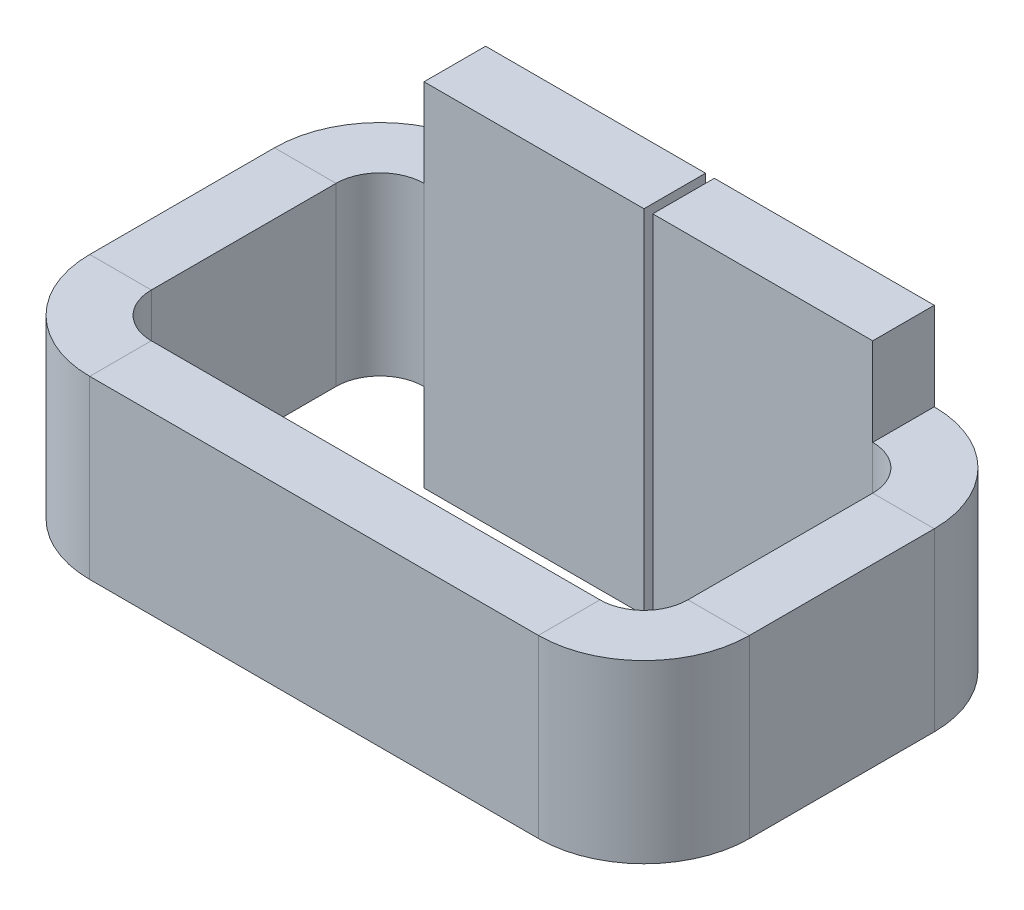
ISO-10303-21;
HEADER;
FILE_DESCRIPTION(('STEP AP214'),'2;1');
FILE_NAME('part.step','',(''),(''),'','','');
FILE_SCHEMA(('AUTOMOTIVE_DESIGN { 1 0 10303 214 1 1 1 1 }'));
ENDSEC;
DATA;
#1=APPLICATION_CONTEXT('core data for automotive mechanical design processes');
#2=APPLICATION_PROTOCOL_DEFINITION('international standard','automotive_design',2000,#1);
#3=PRODUCT_CONTEXT('',#1,'mechanical');
#4=PRODUCT('Part','Part','',(#3));
#5=PRODUCT_RELATED_PRODUCT_CATEGORY('part','',(#4));
#6=PRODUCT_DEFINITION_FORMATION('','',#4);
#7=PRODUCT_DEFINITION_CONTEXT('part definition',#1,'design');
#8=PRODUCT_DEFINITION('design','',#6,#7);
#9=PRODUCT_DEFINITION_SHAPE('','',#8);
#10=(LENGTH_UNIT() NAMED_UNIT(*) SI_UNIT(.MILLI.,.METRE.));
#11=(NAMED_UNIT(*) PLANE_ANGLE_UNIT() SI_UNIT($,.RADIAN.));
#12=(NAMED_UNIT(*) SI_UNIT($,.STERADIAN.) SOLID_ANGLE_UNIT());
#13=UNCERTAINTY_MEASURE_WITH_UNIT(LENGTH_MEASURE(1.E-05),#10,'distance_accuracy_value','');
#14=(GEOMETRIC_REPRESENTATION_CONTEXT(3) GLOBAL_UNCERTAINTY_ASSIGNED_CONTEXT((#13)) GLOBAL_UNIT_ASSIGNED_CONTEXT((#10,
#11,#12)) REPRESENTATION_CONTEXT('',''));
#15=CARTESIAN_POINT('',(0.,0.,0.));
#16=DIRECTION('',(0.,0.,1.));
#17=DIRECTION('',(1.,0.,0.));
#18=AXIS2_PLACEMENT_3D('',#15,#16,#17);
#19=CARTESIAN_POINT('',(3.7186584278201,-0.507055120000001,2.286));
#20=DIRECTION('',(0.,1.,0.));
#21=DIRECTION('',(1.,0.,0.));
#22=AXIS2_PLACEMENT_3D('',#19,#20,#21);
#23=PLANE('',#22);
#24=DIRECTION('',(0.,0.,1.));
#25=VECTOR('',#24,1.);
#26=CARTESIAN_POINT('',(-1.29548128,-0.507055119999999,1.9304));
#27=LINE('',#26,#25);
#28=CARTESIAN_POINT('',(-1.29548128,-0.507055119999999,1.9304));
#29=VERTEX_POINT('',#28);
#30=CARTESIAN_POINT('',(-1.29548128,-0.507055119999999,2.286));
#31=VERTEX_POINT('',#30);
#32=EDGE_CURVE('E11',#29,#31,#27,.T.);
#33=ORIENTED_EDGE('',*,*,#32,.F.);
#34=DIRECTION('',(1.,0.,0.));
#35=VECTOR('',#34,1.);
#36=CARTESIAN_POINT('',(3.7186584278201,-0.507055120000001,1.9304));
#37=LINE('',#36,#35);
#38=CARTESIAN_POINT('',(1.29531872,-0.50705512,1.9304));
#39=VERTEX_POINT('',#38);
#40=EDGE_CURVE('E23',#29,#39,#37,.T.);
#41=ORIENTED_EDGE('',*,*,#40,.T.);
#42=DIRECTION('',(0.,0.,-1.));
#43=VECTOR('',#42,1.);
#44=CARTESIAN_POINT('',(1.29531872,-0.50705512,2.286));
#45=LINE('',#44,#43);
#46=CARTESIAN_POINT('',(1.29531872,-0.50705512,2.286));
#47=VERTEX_POINT('',#46);
#48=EDGE_CURVE('E511',#47,#39,#45,.T.);
#49=ORIENTED_EDGE('',*,*,#48,.F.);
#50=DIRECTION('',(1.,0.,0.));
#51=VECTOR('',#50,1.);
#52=CARTESIAN_POINT('',(3.7186584278201,-0.507055120000001,2.286));
#53=LINE('',#52,#51);
#54=EDGE_CURVE('E508',#31,#47,#53,.T.);
#55=ORIENTED_EDGE('',*,*,#54,.F.);
#56=EDGE_LOOP('',(#33,#41,#49,#55));
#57=FACE_BOUND('',#56,.T.);
#58=ADVANCED_FACE('F16',(#57),#23,.F.);
#59=CARTESIAN_POINT('',(3.7186584278201,0.508944879999999,2.286));
#60=DIRECTION('',(0.,-1.,0.));
#61=DIRECTION('',(-1.,0.,0.));
#62=AXIS2_PLACEMENT_3D('',#59,#60,#61);
#63=PLANE('',#62);
#64=DIRECTION('',(0.,0.,-1.));
#65=VECTOR('',#64,1.);
#66=CARTESIAN_POINT('',(-1.29548128,0.508944880000001,2.286));
#67=LINE('',#66,#65);
#68=CARTESIAN_POINT('',(-1.29548128,0.508944880000001,2.286));
#69=VERTEX_POINT('',#68);
#70=CARTESIAN_POINT('',(-1.29548128,0.508944880000001,1.9304));
#71=VERTEX_POINT('',#70);
#72=EDGE_CURVE('E506',#69,#71,#67,.T.);
#73=ORIENTED_EDGE('',*,*,#72,.F.);
#74=DIRECTION('',(-1.,0.,0.));
#75=VECTOR('',#74,1.);
#76=CARTESIAN_POINT('',(3.7186584278201,0.508944879999999,2.286));
#77=LINE('',#76,#75);
#78=CARTESIAN_POINT('',(1.29531872,0.50894488,2.286));
#79=VERTEX_POINT('',#78);
#80=EDGE_CURVE('E503',#79,#69,#77,.T.);
#81=ORIENTED_EDGE('',*,*,#80,.F.);
#82=DIRECTION('',(0.,0.,1.));
#83=VECTOR('',#82,1.);
#84=CARTESIAN_POINT('',(1.29531872,0.50894488,1.9304));
#85=LINE('',#84,#83);
#86=CARTESIAN_POINT('',(1.29531872,0.50894488,1.9304));
#87=VERTEX_POINT('',#86);
#88=EDGE_CURVE('E500',#87,#79,#85,.T.);
#89=ORIENTED_EDGE('',*,*,#88,.F.);
#90=DIRECTION('',(-1.,0.,0.));
#91=VECTOR('',#90,1.);
#92=CARTESIAN_POINT('',(3.7186584278201,0.508944879999999,1.9304));
#93=LINE('',#92,#91);
#94=EDGE_CURVE('E497',#87,#71,#93,.T.);
#95=ORIENTED_EDGE('',*,*,#94,.T.);
#96=EDGE_LOOP('',(#73,#81,#89,#95));
#97=FACE_BOUND('',#96,.T.);
#98=ADVANCED_FACE('F611',(#97),#63,.F.);
#99=CARTESIAN_POINT('',(1.29531872,-1.01505512,2.286));
#100=DIRECTION('',(0.,0.,1.));
#101=DIRECTION('',(-1.,0.,0.));
#102=AXIS2_PLACEMENT_3D('',#99,#100,#101);
#103=PLANE('',#102);
#104=ORIENTED_EDGE('',*,*,#80,.T.);
#105=DIRECTION('',(0.,1.,0.));
#106=VECTOR('',#105,1.);
#107=CARTESIAN_POINT('',(-1.29548128,-1.01505512,2.286));
#108=LINE('',#107,#106);
#109=EDGE_CURVE('E494',#31,#69,#108,.T.);
#110=ORIENTED_EDGE('',*,*,#109,.F.);
#111=ORIENTED_EDGE('',*,*,#54,.T.);
#112=DIRECTION('',(0.,1.,0.));
#113=VECTOR('',#112,1.);
#114=CARTESIAN_POINT('',(1.29531872,-1.01505512,2.286));
#115=LINE('',#114,#113);
#116=EDGE_CURVE('E491',#47,#79,#115,.T.);
#117=ORIENTED_EDGE('',*,*,#116,.T.);
#118=EDGE_LOOP('',(#104,#110,#111,#117));
#119=FACE_BOUND('',#118,.T.);
#120=ADVANCED_FACE('F542',(#119),#103,.T.);
#121=CARTESIAN_POINT('',(1.29531872,-1.01505512,1.9304));
#122=DIRECTION('',(0.,0.,1.));
#123=DIRECTION('',(-1.,0.,0.));
#124=AXIS2_PLACEMENT_3D('',#121,#122,#123);
#125=PLANE('',#124);
#126=DIRECTION('',(0.,1.,0.));
#127=VECTOR('',#126,1.);
#128=CARTESIAN_POINT('',(-1.29548128,-1.01505512,1.9304));
#129=LINE('',#128,#127);
#130=EDGE_CURVE('E488',#29,#71,#129,.T.);
#131=ORIENTED_EDGE('',*,*,#130,.T.);
#132=ORIENTED_EDGE('',*,*,#94,.F.);
#133=DIRECTION('',(0.,1.,0.));
#134=VECTOR('',#133,1.);
#135=CARTESIAN_POINT('',(1.29531872,-1.01505512,1.9304));
#136=LINE('',#135,#134);
#137=EDGE_CURVE('E485',#39,#87,#136,.T.);
#138=ORIENTED_EDGE('',*,*,#137,.F.);
#139=ORIENTED_EDGE('',*,*,#40,.F.);
#140=EDGE_LOOP('',(#131,#132,#138,#139));
#141=FACE_BOUND('',#140,.T.);
#142=ADVANCED_FACE('F525',(#141),#125,.F.);
#143=CARTESIAN_POINT('',(0.02531872,-1.01505512,0.));
#144=DIRECTION('',(-1.,0.,0.));
#145=DIRECTION('',(0.,0.,-1.));
#146=AXIS2_PLACEMENT_3D('',#143,#144,#145);
#147=PLANE('',#146);
#148=DIRECTION('',(0.,0.,1.));
#149=VECTOR('',#148,1.);
#150=CARTESIAN_POINT('',(0.0253187200000005,1.01694488,0.));
#151=LINE('',#150,#149);
#152=CARTESIAN_POINT('',(0.0253187200000005,1.01694488,0.));
#153=VERTEX_POINT('',#152);
#154=CARTESIAN_POINT('',(0.0253187200000005,1.01694488,0.3556));
#155=VERTEX_POINT('',#154);
#156=EDGE_CURVE('E482',#153,#155,#151,.T.);
#157=ORIENTED_EDGE('',*,*,#156,.F.);
#158=DIRECTION('',(0.,1.,0.));
#159=VECTOR('',#158,1.);
#160=CARTESIAN_POINT('',(0.02531872,-1.01505512,0.));
#161=LINE('',#160,#159);
#162=CARTESIAN_POINT('',(0.02531872,-1.01505512,0.));
#163=VERTEX_POINT('',#162);
#164=EDGE_CURVE('E478',#163,#153,#161,.T.);
#165=ORIENTED_EDGE('',*,*,#164,.F.);
#166=DIRECTION('',(0.,0.,1.));
#167=VECTOR('',#166,1.);
#168=CARTESIAN_POINT('',(0.02531872,-1.01505512,0.));
#169=LINE('',#168,#167);
#170=CARTESIAN_POINT('',(0.02531872,-1.01505512,0.3556));
#171=VERTEX_POINT('',#170);
#172=EDGE_CURVE('E475',#163,#171,#169,.T.);
#173=ORIENTED_EDGE('',*,*,#172,.T.);
#174=DIRECTION('',(0.,1.,0.));
#175=VECTOR('',#174,1.);
#176=CARTESIAN_POINT('',(0.02531872,-1.01505512,0.3556));
#177=LINE('',#176,#175);
#178=EDGE_CURVE('E471',#171,#155,#177,.T.);
#179=ORIENTED_EDGE('',*,*,#178,.T.);
#180=EDGE_LOOP('',(#157,#165,#173,#179));
#181=FACE_BOUND('',#180,.T.);
#182=ADVANCED_FACE('F623',(#181),#147,.T.);
#183=CARTESIAN_POINT('',(1.54931872,-1.01505512,0.6096));
#184=DIRECTION('',(0.,-1.,0.));
#185=DIRECTION('',(1.,0.,0.));
#186=AXIS2_PLACEMENT_3D('',#183,#184,#185);
#187=PLANE('',#186);
#188=DIRECTION('',(-1.,0.,0.));
#189=VECTOR('',#188,1.);
#190=CARTESIAN_POINT('',(0.02531872,-1.01505512,0.));
#191=LINE('',#190,#189);
#192=CARTESIAN_POINT('',(1.29531872,-1.01505512,0.));
#193=VERTEX_POINT('',#192);
#194=EDGE_CURVE('E467',#193,#163,#191,.T.);
#195=ORIENTED_EDGE('',*,*,#194,.F.);
#196=DIRECTION('',(0.,0.,1.));
#197=VECTOR('',#196,1.);
#198=CARTESIAN_POINT('',(1.29531872,-1.01505512,0.));
#199=LINE('',#198,#197);
#200=CARTESIAN_POINT('',(1.29531872,-1.01505512,0.3556));
#201=VERTEX_POINT('',#200);
#202=EDGE_CURVE('E463',#193,#201,#199,.T.);
#203=ORIENTED_EDGE('',*,*,#202,.T.);
#204=DIRECTION('',(-1.,0.,0.));
#205=VECTOR('',#204,1.);
#206=CARTESIAN_POINT('',(0.02531872,-1.01505512,0.3556));
#207=LINE('',#206,#205);
#208=EDGE_CURVE('E459',#201,#171,#207,.T.);
#209=ORIENTED_EDGE('',*,*,#208,.T.);
#210=ORIENTED_EDGE('',*,*,#172,.F.);
#211=EDGE_LOOP('',(#195,#203,#209,#210));
#212=FACE_BOUND('',#211,.T.);
#213=ADVANCED_FACE('F626',(#212),#187,.T.);
#214=CARTESIAN_POINT('',(1.29531872,1.01694488,0.6096));
#215=DIRECTION('',(0.,1.,0.));
#216=DIRECTION('',(-1.,0.,0.));
#217=AXIS2_PLACEMENT_3D('',#214,#215,#216);
#218=PLANE('',#217);
#219=DIRECTION('',(-1.,0.,0.));
#220=VECTOR('',#219,1.);
#221=CARTESIAN_POINT('',(0.0253187200000005,1.01694488,0.3556));
#222=LINE('',#221,#220);
#223=CARTESIAN_POINT('',(1.29531872,1.01694488,0.3556));
#224=VERTEX_POINT('',#223);
#225=EDGE_CURVE('E455',#224,#155,#222,.T.);
#226=ORIENTED_EDGE('',*,*,#225,.F.);
#227=DIRECTION('',(0.,0.,-1.));
#228=VECTOR('',#227,1.);
#229=CARTESIAN_POINT('',(1.29531872,1.01694488,0.3556));
#230=LINE('',#229,#228);
#231=CARTESIAN_POINT('',(1.29531872,1.01694488,0.));
#232=VERTEX_POINT('',#231);
#233=EDGE_CURVE('E451',#224,#232,#230,.T.);
#234=ORIENTED_EDGE('',*,*,#233,.T.);
#235=DIRECTION('',(-1.,0.,0.));
#236=VECTOR('',#235,1.);
#237=CARTESIAN_POINT('',(0.0253187200000005,1.01694488,0.));
#238=LINE('',#237,#236);
#239=EDGE_CURVE('E447',#232,#153,#238,.T.);
#240=ORIENTED_EDGE('',*,*,#239,.T.);
#241=ORIENTED_EDGE('',*,*,#156,.T.);
#242=EDGE_LOOP('',(#226,#234,#240,#241));
#243=FACE_BOUND('',#242,.T.);
#244=ADVANCED_FACE('F630',(#243),#218,.T.);
#245=CARTESIAN_POINT('',(1.29531872,1.01694488,0.));
#246=DIRECTION('',(-1.,0.,0.));
#247=DIRECTION('',(0.,-1.,0.));
#248=AXIS2_PLACEMENT_3D('',#245,#246,#247);
#249=PLANE('',#248);
#250=DIRECTION('',(0.,-1.,0.));
#251=VECTOR('',#250,1.);
#252=CARTESIAN_POINT('',(1.29531872,1.01694488,0.3556));
#253=LINE('',#252,#251);
#254=CARTESIAN_POINT('',(1.29531872,0.50894488,0.3556));
#255=VERTEX_POINT('',#254);
#256=EDGE_CURVE('E444',#224,#255,#253,.T.);
#257=ORIENTED_EDGE('',*,*,#256,.T.);
#258=DIRECTION('',(0.,0.,1.));
#259=VECTOR('',#258,1.);
#260=CARTESIAN_POINT('',(1.29531872,0.50894488,0.));
#261=LINE('',#260,#259);
#262=CARTESIAN_POINT('',(1.29531872,0.50894488,0.));
#263=VERTEX_POINT('',#262);
#264=EDGE_CURVE('E440',#263,#255,#261,.T.);
#265=ORIENTED_EDGE('',*,*,#264,.F.);
#266=DIRECTION('',(0.,-1.,0.));
#267=VECTOR('',#266,1.);
#268=CARTESIAN_POINT('',(1.29531872,1.01694488,0.));
#269=LINE('',#268,#267);
#270=EDGE_CURVE('E436',#232,#263,#269,.T.);
#271=ORIENTED_EDGE('',*,*,#270,.F.);
#272=ORIENTED_EDGE('',*,*,#233,.F.);
#273=EDGE_LOOP('',(#257,#265,#271,#272));
#274=FACE_BOUND('',#273,.T.);
#275=ADVANCED_FACE('F634',(#274),#249,.F.);
#276=CARTESIAN_POINT('',(0.02531872,-1.01505512,0.3556));
#277=DIRECTION('',(0.,0.,-1.));
#278=DIRECTION('',(1.,0.,0.));
#279=AXIS2_PLACEMENT_3D('',#276,#277,#278);
#280=PLANE('',#279);
#281=ORIENTED_EDGE('',*,*,#225,.T.);
#282=ORIENTED_EDGE('',*,*,#178,.F.);
#283=ORIENTED_EDGE('',*,*,#208,.F.);
#284=DIRECTION('',(0.,1.,0.));
#285=VECTOR('',#284,1.);
#286=CARTESIAN_POINT('',(1.29531872,-1.01505512,0.3556));
#287=LINE('',#286,#285);
#288=CARTESIAN_POINT('',(1.29531872,-0.50705512,0.3556));
#289=VERTEX_POINT('',#288);
#290=EDGE_CURVE('E432',#201,#289,#287,.T.);
#291=ORIENTED_EDGE('',*,*,#290,.T.);
#292=DIRECTION('',(0.,1.,0.));
#293=VECTOR('',#292,1.);
#294=CARTESIAN_POINT('',(1.29531872,-1.01505512,0.3556));
#295=LINE('',#294,#293);
#296=EDGE_CURVE('E428',#289,#255,#295,.T.);
#297=ORIENTED_EDGE('',*,*,#296,.T.);
#298=ORIENTED_EDGE('',*,*,#256,.F.);
#299=EDGE_LOOP('',(#281,#282,#283,#291,#297,#298));
#300=FACE_BOUND('',#299,.T.);
#301=ADVANCED_FACE('F638',(#300),#280,.F.);
#302=CARTESIAN_POINT('',(1.29531872,-1.01505512,0.));
#303=DIRECTION('',(-1.,0.,0.));
#304=DIRECTION('',(0.,-1.,0.));
#305=AXIS2_PLACEMENT_3D('',#302,#303,#304);
#306=PLANE('',#305);
#307=ORIENTED_EDGE('',*,*,#290,.F.);
#308=ORIENTED_EDGE('',*,*,#202,.F.);
#309=DIRECTION('',(0.,1.,0.));
#310=VECTOR('',#309,1.);
#311=CARTESIAN_POINT('',(1.29531872,-1.01505512,0.));
#312=LINE('',#311,#310);
#313=CARTESIAN_POINT('',(1.29531872,-0.50705512,0.));
#314=VERTEX_POINT('',#313);
#315=EDGE_CURVE('E424',#193,#314,#312,.T.);
#316=ORIENTED_EDGE('',*,*,#315,.T.);
#317=DIRECTION('',(0.,0.,1.));
#318=VECTOR('',#317,1.);
#319=CARTESIAN_POINT('',(1.29531872,-0.50705512,0.));
#320=LINE('',#319,#318);
#321=EDGE_CURVE('E420',#314,#289,#320,.T.);
#322=ORIENTED_EDGE('',*,*,#321,.T.);
#323=EDGE_LOOP('',(#307,#308,#316,#322));
#324=FACE_BOUND('',#323,.T.);
#325=ADVANCED_FACE('F642',(#324),#306,.F.);
#326=CARTESIAN_POINT('',(0.02531872,-1.01505512,0.));
#327=DIRECTION('',(0.,0.,-1.));
#328=DIRECTION('',(1.,0.,0.));
#329=AXIS2_PLACEMENT_3D('',#326,#327,#328);
#330=PLANE('',#329);
#331=ORIENTED_EDGE('',*,*,#239,.F.);
#332=ORIENTED_EDGE('',*,*,#270,.T.);
#333=DIRECTION('',(0.,1.,0.));
#334=VECTOR('',#333,1.);
#335=CARTESIAN_POINT('',(1.29531872,-1.01505512,0.));
#336=LINE('',#335,#334);
#337=EDGE_CURVE('E416',#314,#263,#336,.T.);
#338=ORIENTED_EDGE('',*,*,#337,.F.);
#339=ORIENTED_EDGE('',*,*,#315,.F.);
#340=ORIENTED_EDGE('',*,*,#194,.T.);
#341=ORIENTED_EDGE('',*,*,#164,.T.);
#342=EDGE_LOOP('',(#331,#332,#338,#339,#340,#341));
#343=FACE_BOUND('',#342,.T.);
#344=ADVANCED_FACE('F646',(#343),#330,.T.);
#345=CARTESIAN_POINT('',(1.29531872,0.50894488,0.6096));
#346=DIRECTION('',(0.,1.,0.));
#347=DIRECTION('',(-1.,0.,0.));
#348=AXIS2_PLACEMENT_3D('',#345,#346,#347);
#349=PLANE('',#348);
#350=ORIENTED_EDGE('',*,*,#264,.T.);
#351=CARTESIAN_POINT('',(1.29531872,0.50894488,0.6096));
#352=DIRECTION('',(0.,-1.,0.));
#353=DIRECTION('',(1.,0.,0.));
#354=AXIS2_PLACEMENT_3D('',#351,#352,#353);
#355=CIRCLE('',#354,0.254);
#356=CARTESIAN_POINT('',(1.54931872,0.50894488,0.609599999999999));
#357=VERTEX_POINT('',#356);
#358=EDGE_CURVE('E413',#255,#357,#355,.T.);
#359=ORIENTED_EDGE('',*,*,#358,.T.);
#360=DIRECTION('',(1.,0.,0.));
#361=VECTOR('',#360,1.);
#362=CARTESIAN_POINT('',(1.54931872,0.50894488,0.6096));
#363=LINE('',#362,#361);
#364=CARTESIAN_POINT('',(1.90491872,0.50894488,0.6096));
#365=VERTEX_POINT('',#364);
#366=EDGE_CURVE('E409',#357,#365,#363,.T.);
#367=ORIENTED_EDGE('',*,*,#366,.T.);
#368=CARTESIAN_POINT('',(1.29531872,0.50894488,0.6096));
#369=DIRECTION('',(0.,-1.,0.));
#370=DIRECTION('',(1.,0.,0.));
#371=AXIS2_PLACEMENT_3D('',#368,#369,#370);
#372=CIRCLE('',#371,0.6096);
#373=EDGE_CURVE('E405',#263,#365,#372,.T.);
#374=ORIENTED_EDGE('',*,*,#373,.F.);
#375=EDGE_LOOP('',(#350,#359,#367,#374));
#376=FACE_BOUND('',#375,.T.);
#377=ADVANCED_FACE('F650',(#376),#349,.T.);
#378=CARTESIAN_POINT('',(1.29531872,1.2732488353201,0.6096));
#379=DIRECTION('',(0.,-1.,0.));
#380=DIRECTION('',(1.,0.,0.));
#381=AXIS2_PLACEMENT_3D('',#378,#379,#380);
#382=CYLINDRICAL_SURFACE('',#381,0.254);
#383=CARTESIAN_POINT('',(1.29531872,-0.50705512,0.6096));
#384=DIRECTION('',(0.,1.,0.));
#385=DIRECTION('',(1.,0.,0.));
#386=AXIS2_PLACEMENT_3D('',#383,#384,#385);
#387=CIRCLE('',#386,0.254);
#388=CARTESIAN_POINT('',(1.54931872,-0.50705512,0.609599999999999));
#389=VERTEX_POINT('',#388);
#390=EDGE_CURVE('E402',#389,#289,#387,.T.);
#391=ORIENTED_EDGE('',*,*,#390,.F.);
#392=DIRECTION('',(0.,1.,0.));
#393=VECTOR('',#392,1.);
#394=CARTESIAN_POINT('',(1.54931872,-1.01505512,0.6096));
#395=LINE('',#394,#393);
#396=EDGE_CURVE('E398',#389,#357,#395,.T.);
#397=ORIENTED_EDGE('',*,*,#396,.T.);
#398=ORIENTED_EDGE('',*,*,#358,.F.);
#399=ORIENTED_EDGE('',*,*,#296,.F.);
#400=EDGE_LOOP('',(#391,#397,#398,#399));
#401=FACE_BOUND('',#400,.T.);
#402=ADVANCED_FACE('F654',(#401),#382,.F.);
#403=CARTESIAN_POINT('',(1.29531872,-0.50705512,0.6096));
#404=DIRECTION('',(0.,-1.,0.));
#405=DIRECTION('',(1.,0.,0.));
#406=AXIS2_PLACEMENT_3D('',#403,#404,#405);
#407=PLANE('',#406);
#408=DIRECTION('',(-1.,0.,0.));
#409=VECTOR('',#408,1.);
#410=CARTESIAN_POINT('',(1.90491872,-0.507055120000001,0.6096));
#411=LINE('',#410,#409);
#412=CARTESIAN_POINT('',(1.90491872,-0.50705512,0.609599999999997));
#413=VERTEX_POINT('',#412);
#414=EDGE_CURVE('E394',#413,#389,#411,.T.);
#415=ORIENTED_EDGE('',*,*,#414,.T.);
#416=ORIENTED_EDGE('',*,*,#390,.T.);
#417=ORIENTED_EDGE('',*,*,#321,.F.);
#418=CARTESIAN_POINT('',(1.29531872,-0.50705512,0.6096));
#419=DIRECTION('',(0.,1.,0.));
#420=DIRECTION('',(-1.,0.,0.));
#421=AXIS2_PLACEMENT_3D('',#418,#419,#420);
#422=CIRCLE('',#421,0.6096);
#423=EDGE_CURVE('E391',#413,#314,#422,.T.);
#424=ORIENTED_EDGE('',*,*,#423,.F.);
#425=EDGE_LOOP('',(#415,#416,#417,#424));
#426=FACE_BOUND('',#425,.T.);
#427=ADVANCED_FACE('F658',(#426),#407,.T.);
#428=CARTESIAN_POINT('',(1.29531872,1.2732488353201,0.6096));
#429=DIRECTION('',(0.,-1.,0.));
#430=DIRECTION('',(1.,0.,0.));
#431=AXIS2_PLACEMENT_3D('',#428,#429,#430);
#432=CYLINDRICAL_SURFACE('',#431,0.6096);
#433=ORIENTED_EDGE('',*,*,#423,.T.);
#434=ORIENTED_EDGE('',*,*,#337,.T.);
#435=ORIENTED_EDGE('',*,*,#373,.T.);
#436=DIRECTION('',(0.,1.,0.));
#437=VECTOR('',#436,1.);
#438=CARTESIAN_POINT('',(1.90491872,-1.01505512,0.6096));
#439=LINE('',#438,#437);
#440=EDGE_CURVE('E387',#413,#365,#439,.T.);
#441=ORIENTED_EDGE('',*,*,#440,.F.);
#442=EDGE_LOOP('',(#433,#434,#435,#441));
#443=FACE_BOUND('',#442,.T.);
#444=ADVANCED_FACE('F662',(#443),#432,.T.);
#445=CARTESIAN_POINT('',(1.90491872,-1.01505512,0.6096));
#446=DIRECTION('',(1.,0.,0.));
#447=DIRECTION('',(0.,0.,1.));
#448=AXIS2_PLACEMENT_3D('',#445,#446,#447);
#449=PLANE('',#448);
#450=DIRECTION('',(0.,0.,1.));
#451=VECTOR('',#450,1.);
#452=CARTESIAN_POINT('',(1.90491872,0.50894488,-0.0686698539100349));
#453=LINE('',#452,#451);
#454=CARTESIAN_POINT('',(1.90491872,0.50894488,1.6764));
#455=VERTEX_POINT('',#454);
#456=EDGE_CURVE('E384',#365,#455,#453,.T.);
#457=ORIENTED_EDGE('',*,*,#456,.T.);
#458=DIRECTION('',(0.,1.,0.));
#459=VECTOR('',#458,1.);
#460=CARTESIAN_POINT('',(1.90491872,-1.01505512,1.6764));
#461=LINE('',#460,#459);
#462=CARTESIAN_POINT('',(1.90491872,-0.50705512,1.6764));
#463=VERTEX_POINT('',#462);
#464=EDGE_CURVE('E380',#463,#455,#461,.T.);
#465=ORIENTED_EDGE('',*,*,#464,.F.);
#466=DIRECTION('',(0.,0.,-1.));
#467=VECTOR('',#466,1.);
#468=CARTESIAN_POINT('',(1.90491872,-0.507055120000001,-0.0686698539100348));
#469=LINE('',#468,#467);
#470=EDGE_CURVE('E376',#463,#413,#469,.T.);
#471=ORIENTED_EDGE('',*,*,#470,.T.);
#472=ORIENTED_EDGE('',*,*,#440,.T.);
#473=EDGE_LOOP('',(#457,#465,#471,#472));
#474=FACE_BOUND('',#473,.T.);
#475=ADVANCED_FACE('F666',(#474),#449,.T.);
#476=CARTESIAN_POINT('',(1.90491872,-0.507055120000001,-0.0686698539100348));
#477=DIRECTION('',(0.,1.,0.));
#478=DIRECTION('',(0.,0.,-1.));
#479=AXIS2_PLACEMENT_3D('',#476,#477,#478);
#480=PLANE('',#479);
#481=DIRECTION('',(1.,0.,0.));
#482=VECTOR('',#481,1.);
#483=CARTESIAN_POINT('',(1.54931872,-0.50705512,1.6764));
#484=LINE('',#483,#482);
#485=CARTESIAN_POINT('',(1.54931872,-0.50705512,1.6764));
#486=VERTEX_POINT('',#485);
#487=EDGE_CURVE('E372',#486,#463,#484,.T.);
#488=ORIENTED_EDGE('',*,*,#487,.F.);
#489=DIRECTION('',(0.,0.,-1.));
#490=VECTOR('',#489,1.);
#491=CARTESIAN_POINT('',(1.54931872,-0.50705512,-0.0686698539100348));
#492=LINE('',#491,#490);
#493=EDGE_CURVE('E368',#486,#389,#492,.T.);
#494=ORIENTED_EDGE('',*,*,#493,.T.);
#495=ORIENTED_EDGE('',*,*,#414,.F.);
#496=ORIENTED_EDGE('',*,*,#470,.F.);
#497=EDGE_LOOP('',(#488,#494,#495,#496));
#498=FACE_BOUND('',#497,.T.);
#499=ADVANCED_FACE('F534',(#498),#480,.F.);
#500=CARTESIAN_POINT('',(1.54931872,-1.01505512,0.6096));
#501=DIRECTION('',(1.,0.,0.));
#502=DIRECTION('',(0.,0.,1.));
#503=AXIS2_PLACEMENT_3D('',#500,#501,#502);
#504=PLANE('',#503);
#505=DIRECTION('',(0.,1.,0.));
#506=VECTOR('',#505,1.);
#507=CARTESIAN_POINT('',(1.54931872,-1.01505512,1.6764));
#508=LINE('',#507,#506);
#509=CARTESIAN_POINT('',(1.54931872,0.50894488,1.6764));
#510=VERTEX_POINT('',#509);
#511=EDGE_CURVE('E364',#486,#510,#508,.T.);
#512=ORIENTED_EDGE('',*,*,#511,.T.);
#513=DIRECTION('',(0.,0.,1.));
#514=VECTOR('',#513,1.);
#515=CARTESIAN_POINT('',(1.54931872,0.50894488,-0.0686698539100349));
#516=LINE('',#515,#514);
#517=EDGE_CURVE('E361',#357,#510,#516,.T.);
#518=ORIENTED_EDGE('',*,*,#517,.F.);
#519=ORIENTED_EDGE('',*,*,#396,.F.);
#520=ORIENTED_EDGE('',*,*,#493,.F.);
#521=EDGE_LOOP('',(#512,#518,#519,#520));
#522=FACE_BOUND('',#521,.T.);
#523=ADVANCED_FACE('F531',(#522),#504,.F.);
#524=CARTESIAN_POINT('',(1.90491872,0.50894488,-0.0686698539100349));
#525=DIRECTION('',(0.,-1.,0.));
#526=DIRECTION('',(0.,0.,1.));
#527=AXIS2_PLACEMENT_3D('',#524,#525,#526);
#528=PLANE('',#527);
#529=DIRECTION('',(-1.,0.,0.));
#530=VECTOR('',#529,1.);
#531=CARTESIAN_POINT('',(1.90491872,0.50894488,1.6764));
#532=LINE('',#531,#530);
#533=EDGE_CURVE('E357',#455,#510,#532,.T.);
#534=ORIENTED_EDGE('',*,*,#533,.F.);
#535=ORIENTED_EDGE('',*,*,#456,.F.);
#536=ORIENTED_EDGE('',*,*,#366,.F.);
#537=ORIENTED_EDGE('',*,*,#517,.T.);
#538=EDGE_LOOP('',(#534,#535,#536,#537));
#539=FACE_BOUND('',#538,.T.);
#540=ADVANCED_FACE('F674',(#539),#528,.F.);
#541=CARTESIAN_POINT('',(1.29531872,0.50894488,1.6764));
#542=DIRECTION('',(0.,1.,0.));
#543=DIRECTION('',(-1.,0.,0.));
#544=AXIS2_PLACEMENT_3D('',#541,#542,#543);
#545=PLANE('',#544);
#546=ORIENTED_EDGE('',*,*,#533,.T.);
#547=CARTESIAN_POINT('',(1.29531872,0.50894488,1.6764));
#548=DIRECTION('',(0.,-1.,0.));
#549=DIRECTION('',(1.,0.,0.));
#550=AXIS2_PLACEMENT_3D('',#547,#548,#549);
#551=CIRCLE('',#550,0.254);
#552=EDGE_CURVE('E353',#510,#87,#551,.T.);
#553=ORIENTED_EDGE('',*,*,#552,.T.);
#554=ORIENTED_EDGE('',*,*,#88,.T.);
#555=CARTESIAN_POINT('',(1.29531872,0.50894488,1.6764));
#556=DIRECTION('',(0.,-1.,0.));
#557=DIRECTION('',(1.,0.,0.));
#558=AXIS2_PLACEMENT_3D('',#555,#556,#557);
#559=CIRCLE('',#558,0.6096);
#560=EDGE_CURVE('E349',#455,#79,#559,.T.);
#561=ORIENTED_EDGE('',*,*,#560,.F.);
#562=EDGE_LOOP('',(#546,#553,#554,#561));
#563=FACE_BOUND('',#562,.T.);
#564=ADVANCED_FACE('F677',(#563),#545,.T.);
#565=CARTESIAN_POINT('',(1.29531872,-0.50705512,1.6764));
#566=DIRECTION('',(0.,-1.,0.));
#567=DIRECTION('',(1.,0.,0.));
#568=AXIS2_PLACEMENT_3D('',#565,#566,#567);
#569=PLANE('',#568);
#570=ORIENTED_EDGE('',*,*,#48,.T.);
#571=CARTESIAN_POINT('',(1.29531872,-0.50705512,1.6764));
#572=DIRECTION('',(0.,1.,0.));
#573=DIRECTION('',(1.,0.,0.));
#574=AXIS2_PLACEMENT_3D('',#571,#572,#573);
#575=CIRCLE('',#574,0.254);
#576=EDGE_CURVE('E345',#39,#486,#575,.T.);
#577=ORIENTED_EDGE('',*,*,#576,.T.);
#578=ORIENTED_EDGE('',*,*,#487,.T.);
#579=CARTESIAN_POINT('',(1.29531872,-0.50705512,1.6764));
#580=DIRECTION('',(0.,1.,0.));
#581=DIRECTION('',(-1.,0.,0.));
#582=AXIS2_PLACEMENT_3D('',#579,#580,#581);
#583=CIRCLE('',#582,0.6096);
#584=EDGE_CURVE('E341',#47,#463,#583,.T.);
#585=ORIENTED_EDGE('',*,*,#584,.F.);
#586=EDGE_LOOP('',(#570,#577,#578,#585));
#587=FACE_BOUND('',#586,.T.);
#588=ADVANCED_FACE('F520',(#587),#569,.T.);
#589=CARTESIAN_POINT('',(1.29531872,1.2732488353201,1.6764));
#590=DIRECTION('',(0.,-1.,0.));
#591=DIRECTION('',(1.,0.,0.));
#592=AXIS2_PLACEMENT_3D('',#589,#590,#591);
#593=CYLINDRICAL_SURFACE('',#592,0.6096);
#594=ORIENTED_EDGE('',*,*,#584,.T.);
#595=ORIENTED_EDGE('',*,*,#464,.T.);
#596=ORIENTED_EDGE('',*,*,#560,.T.);
#597=ORIENTED_EDGE('',*,*,#116,.F.);
#598=EDGE_LOOP('',(#594,#595,#596,#597));
#599=FACE_BOUND('',#598,.T.);
#600=ADVANCED_FACE('F539',(#599),#593,.T.);
#601=CARTESIAN_POINT('',(1.29531872,1.2732488353201,1.6764));
#602=DIRECTION('',(0.,-1.,0.));
#603=DIRECTION('',(1.,0.,0.));
#604=AXIS2_PLACEMENT_3D('',#601,#602,#603);
#605=CYLINDRICAL_SURFACE('',#604,0.254);
#606=ORIENTED_EDGE('',*,*,#576,.F.);
#607=ORIENTED_EDGE('',*,*,#137,.T.);
#608=ORIENTED_EDGE('',*,*,#552,.F.);
#609=ORIENTED_EDGE('',*,*,#511,.F.);
#610=EDGE_LOOP('',(#606,#607,#608,#609));
#611=FACE_BOUND('',#610,.T.);
#612=ADVANCED_FACE('F528',(#611),#605,.F.);
#613=CARTESIAN_POINT('',(-1.29548128,0.508944880000001,1.6764));
#614=DIRECTION('',(0.,1.,0.));
#615=DIRECTION('',(-1.,0.,0.));
#616=AXIS2_PLACEMENT_3D('',#613,#614,#615);
#617=PLANE('',#616);
#618=ORIENTED_EDGE('',*,*,#72,.T.);
#619=CARTESIAN_POINT('',(-1.29548128,0.508944880000001,1.6764));
#620=DIRECTION('',(0.,-1.,0.));
#621=DIRECTION('',(1.,0.,0.));
#622=AXIS2_PLACEMENT_3D('',#619,#620,#621);
#623=CIRCLE('',#622,0.254);
#624=CARTESIAN_POINT('',(-1.54948128,0.508944880000001,1.6764));
#625=VERTEX_POINT('',#624);
#626=EDGE_CURVE('E338',#71,#625,#623,.T.);
#627=ORIENTED_EDGE('',*,*,#626,.T.);
#628=DIRECTION('',(-1.,0.,0.));
#629=VECTOR('',#628,1.);
#630=CARTESIAN_POINT('',(-1.54948128,0.508944880000001,1.6764));
#631=LINE('',#630,#629);
#632=CARTESIAN_POINT('',(-1.90508128,0.508944880000001,1.6764));
#633=VERTEX_POINT('',#632);
#634=EDGE_CURVE('E335',#625,#633,#631,.T.);
#635=ORIENTED_EDGE('',*,*,#634,.T.);
#636=CARTESIAN_POINT('',(-1.29548128,0.508944880000001,1.6764));
#637=DIRECTION('',(0.,-1.,0.));
#638=DIRECTION('',(1.,0.,0.));
#639=AXIS2_PLACEMENT_3D('',#636,#637,#638);
#640=CIRCLE('',#639,0.6096);
#641=EDGE_CURVE('E332',#69,#633,#640,.T.);
#642=ORIENTED_EDGE('',*,*,#641,.F.);
#643=EDGE_LOOP('',(#618,#627,#635,#642));
#644=FACE_BOUND('',#643,.T.);
#645=ADVANCED_FACE('F549',(#644),#617,.T.);
#646=CARTESIAN_POINT('',(-1.29548128,-0.507055119999999,1.6764));
#647=DIRECTION('',(0.,-1.,0.));
#648=DIRECTION('',(1.,0.,0.));
#649=AXIS2_PLACEMENT_3D('',#646,#647,#648);
#650=PLANE('',#649);
#651=DIRECTION('',(1.,0.,0.));
#652=VECTOR('',#651,1.);
#653=CARTESIAN_POINT('',(-1.90508128,-0.507055119999999,1.6764));
#654=LINE('',#653,#652);
#655=CARTESIAN_POINT('',(-1.90508128,-0.507055119999999,1.6764));
#656=VERTEX_POINT('',#655);
#657=CARTESIAN_POINT('',(-1.54948128,-0.507055119999999,1.6764));
#658=VERTEX_POINT('',#657);
#659=EDGE_CURVE('E329',#656,#658,#654,.T.);
#660=ORIENTED_EDGE('',*,*,#659,.T.);
#661=CARTESIAN_POINT('',(-1.29548128,-0.507055119999998,1.6764));
#662=DIRECTION('',(0.,1.,0.));
#663=DIRECTION('',(1.,0.,0.));
#664=AXIS2_PLACEMENT_3D('',#661,#662,#663);
#665=CIRCLE('',#664,0.254);
#666=EDGE_CURVE('E327',#658,#29,#665,.T.);
#667=ORIENTED_EDGE('',*,*,#666,.T.);
#668=ORIENTED_EDGE('',*,*,#32,.T.);
#669=CARTESIAN_POINT('',(-1.29548128,-0.507055119999999,1.6764));
#670=DIRECTION('',(0.,1.,0.));
#671=DIRECTION('',(-1.,0.,0.));
#672=AXIS2_PLACEMENT_3D('',#669,#670,#671);
#673=CIRCLE('',#672,0.6096);
#674=EDGE_CURVE('E325',#656,#31,#673,.T.);
#675=ORIENTED_EDGE('',*,*,#674,.F.);
#676=EDGE_LOOP('',(#660,#667,#668,#675));
#677=FACE_BOUND('',#676,.T.);
#678=ADVANCED_FACE('F572',(#677),#650,.T.);
#679=CARTESIAN_POINT('',(-1.29548128,1.2732488353201,1.6764));
#680=DIRECTION('',(0.,-1.,0.));
#681=DIRECTION('',(1.,0.,0.));
#682=AXIS2_PLACEMENT_3D('',#679,#680,#681);
#683=CYLINDRICAL_SURFACE('',#682,0.6096);
#684=ORIENTED_EDGE('',*,*,#674,.T.);
#685=ORIENTED_EDGE('',*,*,#109,.T.);
#686=ORIENTED_EDGE('',*,*,#641,.T.);
#687=DIRECTION('',(0.,1.,0.));
#688=VECTOR('',#687,1.);
#689=CARTESIAN_POINT('',(-1.90508128,-1.01505512,1.6764));
#690=LINE('',#689,#688);
#691=EDGE_CURVE('E323',#656,#633,#690,.T.);
#692=ORIENTED_EDGE('',*,*,#691,.F.);
#693=EDGE_LOOP('',(#684,#685,#686,#692));
#694=FACE_BOUND('',#693,.T.);
#695=ADVANCED_FACE('F546',(#694),#683,.T.);
#696=CARTESIAN_POINT('',(-1.29548128,1.2732488353201,1.6764));
#697=DIRECTION('',(0.,-1.,0.));
#698=DIRECTION('',(1.,0.,0.));
#699=AXIS2_PLACEMENT_3D('',#696,#697,#698);
#700=CYLINDRICAL_SURFACE('',#699,0.254);
#701=ORIENTED_EDGE('',*,*,#666,.F.);
#702=DIRECTION('',(0.,1.,0.));
#703=VECTOR('',#702,1.);
#704=CARTESIAN_POINT('',(-1.54948128,-1.01505512,1.6764));
#705=LINE('',#704,#703);
#706=EDGE_CURVE('E321',#658,#625,#705,.T.);
#707=ORIENTED_EDGE('',*,*,#706,.T.);
#708=ORIENTED_EDGE('',*,*,#626,.F.);
#709=ORIENTED_EDGE('',*,*,#130,.F.);
#710=EDGE_LOOP('',(#701,#707,#708,#709));
#711=FACE_BOUND('',#710,.T.);
#712=ADVANCED_FACE('F575',(#711),#700,.F.);
#713=CARTESIAN_POINT('',(-1.90508128,-1.01505512,0.609600000000001));
#714=DIRECTION('',(-1.,0.,0.));
#715=DIRECTION('',(0.,-1.,0.));
#716=AXIS2_PLACEMENT_3D('',#713,#714,#715);
#717=PLANE('',#716);
#718=DIRECTION('',(0.,0.,-1.));
#719=VECTOR('',#718,1.);
#720=CARTESIAN_POINT('',(-1.90508128,0.508944880000001,7.3688095617301));
#721=LINE('',#720,#719);
#722=CARTESIAN_POINT('',(-1.90508128,0.508944880000001,0.609600000000001));
#723=VERTEX_POINT('',#722);
#724=EDGE_CURVE('E318',#633,#723,#721,.T.);
#725=ORIENTED_EDGE('',*,*,#724,.T.);
#726=DIRECTION('',(0.,1.,0.));
#727=VECTOR('',#726,1.);
#728=CARTESIAN_POINT('',(-1.90508128,-1.01505512,0.609600000000001));
#729=LINE('',#728,#727);
#730=CARTESIAN_POINT('',(-1.90508128,-0.507055119999999,0.609600000000001));
#731=VERTEX_POINT('',#730);
#732=EDGE_CURVE('E315',#731,#723,#729,.T.);
#733=ORIENTED_EDGE('',*,*,#732,.F.);
#734=DIRECTION('',(0.,0.,1.));
#735=VECTOR('',#734,1.);
#736=CARTESIAN_POINT('',(-1.90508128,-0.507055119999999,7.3688095617301));
#737=LINE('',#736,#735);
#738=EDGE_CURVE('E313',#731,#656,#737,.T.);
#739=ORIENTED_EDGE('',*,*,#738,.T.);
#740=ORIENTED_EDGE('',*,*,#691,.T.);
#741=EDGE_LOOP('',(#725,#733,#739,#740));
#742=FACE_BOUND('',#741,.T.);
#743=ADVANCED_FACE('F559',(#742),#717,.T.);
#744=CARTESIAN_POINT('',(-1.90508128,0.508944880000001,7.3688095617301));
#745=DIRECTION('',(0.,-1.,0.));
#746=DIRECTION('',(0.,0.,-1.));
#747=AXIS2_PLACEMENT_3D('',#744,#745,#746);
#748=PLANE('',#747);
#749=DIRECTION('',(1.,0.,0.));
#750=VECTOR('',#749,1.);
#751=CARTESIAN_POINT('',(-1.90508128,0.508944880000001,0.609600000000001));
#752=LINE('',#751,#750);
#753=CARTESIAN_POINT('',(-1.54948128,0.508944880000001,0.609600000000001));
#754=VERTEX_POINT('',#753);
#755=EDGE_CURVE('E310',#723,#754,#752,.T.);
#756=ORIENTED_EDGE('',*,*,#755,.F.);
#757=ORIENTED_EDGE('',*,*,#724,.F.);
#758=ORIENTED_EDGE('',*,*,#634,.F.);
#759=DIRECTION('',(0.,0.,-1.));
#760=VECTOR('',#759,1.);
#761=CARTESIAN_POINT('',(-1.54948128,0.508944880000001,7.3688095617301));
#762=LINE('',#761,#760);
#763=EDGE_CURVE('E307',#625,#754,#762,.T.);
#764=ORIENTED_EDGE('',*,*,#763,.T.);
#765=EDGE_LOOP('',(#756,#757,#758,#764));
#766=FACE_BOUND('',#765,.T.);
#767=ADVANCED_FACE('F554',(#766),#748,.F.);
#768=CARTESIAN_POINT('',(-1.54948128,-1.01505512,0.609600000000001));
#769=DIRECTION('',(-1.,0.,0.));
#770=DIRECTION('',(0.,-1.,0.));
#771=AXIS2_PLACEMENT_3D('',#768,#769,#770);
#772=PLANE('',#771);
#773=DIRECTION('',(0.,1.,0.));
#774=VECTOR('',#773,1.);
#775=CARTESIAN_POINT('',(-1.54948128,-1.01505512,0.609600000000001));
#776=LINE('',#775,#774);
#777=CARTESIAN_POINT('',(-1.54948128,-0.507055119999999,0.609600000000001));
#778=VERTEX_POINT('',#777);
#779=EDGE_CURVE('E303',#778,#754,#776,.T.);
#780=ORIENTED_EDGE('',*,*,#779,.T.);
#781=ORIENTED_EDGE('',*,*,#763,.F.);
#782=ORIENTED_EDGE('',*,*,#706,.F.);
#783=DIRECTION('',(0.,0.,1.));
#784=VECTOR('',#783,1.);
#785=CARTESIAN_POINT('',(-1.54948128,-0.507055119999999,7.3688095617301));
#786=LINE('',#785,#784);
#787=EDGE_CURVE('E299',#778,#658,#786,.T.);
#788=ORIENTED_EDGE('',*,*,#787,.F.);
#789=EDGE_LOOP('',(#780,#781,#782,#788));
#790=FACE_BOUND('',#789,.T.);
#791=ADVANCED_FACE('F578',(#790),#772,.F.);
#792=CARTESIAN_POINT('',(-1.90508128,-0.507055119999999,7.3688095617301));
#793=DIRECTION('',(0.,1.,0.));
#794=DIRECTION('',(0.,0.,1.));
#795=AXIS2_PLACEMENT_3D('',#792,#793,#794);
#796=PLANE('',#795);
#797=DIRECTION('',(-1.,0.,0.));
#798=VECTOR('',#797,1.);
#799=CARTESIAN_POINT('',(-1.54948128,-0.507055119999999,0.609600000000001));
#800=LINE('',#799,#798);
#801=EDGE_CURVE('E295',#778,#731,#800,.T.);
#802=ORIENTED_EDGE('',*,*,#801,.F.);
#803=ORIENTED_EDGE('',*,*,#787,.T.);
#804=ORIENTED_EDGE('',*,*,#659,.F.);
#805=ORIENTED_EDGE('',*,*,#738,.F.);
#806=EDGE_LOOP('',(#802,#803,#804,#805));
#807=FACE_BOUND('',#806,.T.);
#808=ADVANCED_FACE('F571',(#807),#796,.F.);
#809=CARTESIAN_POINT('',(-1.29548128,0.508944880000001,0.609600000000001));
#810=DIRECTION('',(0.,1.,0.));
#811=DIRECTION('',(-1.,0.,0.));
#812=AXIS2_PLACEMENT_3D('',#809,#810,#811);
#813=PLANE('',#812);
#814=ORIENTED_EDGE('',*,*,#755,.T.);
#815=CARTESIAN_POINT('',(-1.29548128,0.508944880000001,0.609600000000001));
#816=DIRECTION('',(0.,-1.,0.));
#817=DIRECTION('',(1.,0.,0.));
#818=AXIS2_PLACEMENT_3D('',#815,#816,#817);
#819=CIRCLE('',#818,0.254);
#820=CARTESIAN_POINT('',(-1.29548128,0.508944880000001,0.355600000000005));
#821=VERTEX_POINT('',#820);
#822=EDGE_CURVE('E292',#754,#821,#819,.T.);
#823=ORIENTED_EDGE('',*,*,#822,.T.);
#824=DIRECTION('',(0.,0.,1.));
#825=VECTOR('',#824,1.);
#826=CARTESIAN_POINT('',(-1.29548128,0.508944880000001,0.));
#827=LINE('',#826,#825);
#828=CARTESIAN_POINT('',(-1.29548128,0.508944880000001,0.));
#829=VERTEX_POINT('',#828);
#830=EDGE_CURVE('E224',#829,#821,#827,.T.);
#831=ORIENTED_EDGE('',*,*,#830,.F.);
#832=CARTESIAN_POINT('',(-1.29548128,0.508944880000001,0.609600000000001));
#833=DIRECTION('',(0.,-1.,0.));
#834=DIRECTION('',(1.,0.,0.));
#835=AXIS2_PLACEMENT_3D('',#832,#833,#834);
#836=CIRCLE('',#835,0.6096);
#837=EDGE_CURVE('E286',#723,#829,#836,.T.);
#838=ORIENTED_EDGE('',*,*,#837,.F.);
#839=EDGE_LOOP('',(#814,#823,#831,#838));
#840=FACE_BOUND('',#839,.T.);
#841=ADVANCED_FACE('F561',(#840),#813,.T.);
#842=CARTESIAN_POINT('',(-1.29548128,-0.507055119999999,0.609600000000001));
#843=DIRECTION('',(0.,-1.,0.));
#844=DIRECTION('',(1.,0.,0.));
#845=AXIS2_PLACEMENT_3D('',#842,#843,#844);
#846=PLANE('',#845);
#847=DIRECTION('',(0.,0.,1.));
#848=VECTOR('',#847,1.);
#849=CARTESIAN_POINT('',(-1.29548128,-0.507055119999999,0.));
#850=LINE('',#849,#848);
#851=CARTESIAN_POINT('',(-1.29548128,-0.507055119999999,0.));
#852=VERTEX_POINT('',#851);
#853=CARTESIAN_POINT('',(-1.29548128,-0.507055119999999,0.355600000000004));
#854=VERTEX_POINT('',#853);
#855=EDGE_CURVE('E282',#852,#854,#850,.T.);
#856=ORIENTED_EDGE('',*,*,#855,.T.);
#857=CARTESIAN_POINT('',(-1.29548128,-0.507055119999999,0.609600000000001));
#858=DIRECTION('',(0.,1.,0.));
#859=DIRECTION('',(1.,0.,0.));
#860=AXIS2_PLACEMENT_3D('',#857,#858,#859);
#861=CIRCLE('',#860,0.254);
#862=EDGE_CURVE('E278',#854,#778,#861,.T.);
#863=ORIENTED_EDGE('',*,*,#862,.T.);
#864=ORIENTED_EDGE('',*,*,#801,.T.);
#865=CARTESIAN_POINT('',(-1.29548128,-0.507055119999999,0.609600000000001));
#866=DIRECTION('',(0.,1.,0.));
#867=DIRECTION('',(-1.,0.,0.));
#868=AXIS2_PLACEMENT_3D('',#865,#866,#867);
#869=CIRCLE('',#868,0.6096);
#870=EDGE_CURVE('E275',#852,#731,#869,.T.);
#871=ORIENTED_EDGE('',*,*,#870,.F.);
#872=EDGE_LOOP('',(#856,#863,#864,#871));
#873=FACE_BOUND('',#872,.T.);
#874=ADVANCED_FACE('F584',(#873),#846,.T.);
#875=CARTESIAN_POINT('',(-1.29548128,1.2732488353201,0.609600000000001));
#876=DIRECTION('',(0.,-1.,0.));
#877=DIRECTION('',(1.,0.,0.));
#878=AXIS2_PLACEMENT_3D('',#875,#876,#877);
#879=CYLINDRICAL_SURFACE('',#878,0.6096);
#880=ORIENTED_EDGE('',*,*,#870,.T.);
#881=ORIENTED_EDGE('',*,*,#732,.T.);
#882=ORIENTED_EDGE('',*,*,#837,.T.);
#883=DIRECTION('',(0.,1.,0.));
#884=VECTOR('',#883,1.);
#885=CARTESIAN_POINT('',(-1.29548128,-1.01505512,0.));
#886=LINE('',#885,#884);
#887=EDGE_CURVE('E272',#852,#829,#886,.T.);
#888=ORIENTED_EDGE('',*,*,#887,.F.);
#889=EDGE_LOOP('',(#880,#881,#882,#888));
#890=FACE_BOUND('',#889,.T.);
#891=ADVANCED_FACE('F564',(#890),#879,.T.);
#892=CARTESIAN_POINT('',(-1.29548128,1.2732488353201,0.609600000000001));
#893=DIRECTION('',(0.,-1.,0.));
#894=DIRECTION('',(1.,0.,0.));
#895=AXIS2_PLACEMENT_3D('',#892,#893,#894);
#896=CYLINDRICAL_SURFACE('',#895,0.254);
#897=ORIENTED_EDGE('',*,*,#862,.F.);
#898=DIRECTION('',(0.,1.,0.));
#899=VECTOR('',#898,1.);
#900=CARTESIAN_POINT('',(-1.29548128,-1.01505512,0.355600000000005));
#901=LINE('',#900,#899);
#902=EDGE_CURVE('E268',#854,#821,#901,.T.);
#903=ORIENTED_EDGE('',*,*,#902,.T.);
#904=ORIENTED_EDGE('',*,*,#822,.F.);
#905=ORIENTED_EDGE('',*,*,#779,.F.);
#906=EDGE_LOOP('',(#897,#903,#904,#905));
#907=FACE_BOUND('',#906,.T.);
#908=ADVANCED_FACE('F581',(#907),#896,.F.);
#909=CARTESIAN_POINT('',(1.29531872,-1.01505512,0.609600000000006));
#910=DIRECTION('',(0.,1.,0.));
#911=DIRECTION('',(-1.,0.,0.));
#912=AXIS2_PLACEMENT_3D('',#909,#910,#911);
#913=PLANE('',#912);
#914=DIRECTION('',(-1.,0.,0.));
#915=VECTOR('',#914,1.);
#916=CARTESIAN_POINT('',(-0.0254812799999988,-1.01505512,0.355600000000008));
#917=LINE('',#916,#915);
#918=CARTESIAN_POINT('',(-0.0254812799999988,-1.01505512,0.355600000000008));
#919=VERTEX_POINT('',#918);
#920=CARTESIAN_POINT('',(-1.29548128,-1.01505512,0.355600000000004));
#921=VERTEX_POINT('',#920);
#922=EDGE_CURVE('E265',#919,#921,#917,.T.);
#923=ORIENTED_EDGE('',*,*,#922,.T.);
#924=DIRECTION('',(0.,0.,-1.));
#925=VECTOR('',#924,1.);
#926=CARTESIAN_POINT('',(-1.29548128,-1.01505512,0.355600000000005));
#927=LINE('',#926,#925);
#928=CARTESIAN_POINT('',(-1.29548128,-1.01505512,0.));
#929=VERTEX_POINT('',#928);
#930=EDGE_CURVE('E263',#921,#929,#927,.T.);
#931=ORIENTED_EDGE('',*,*,#930,.T.);
#932=DIRECTION('',(-1.,0.,0.));
#933=VECTOR('',#932,1.);
#934=CARTESIAN_POINT('',(-0.0254812799999988,-1.01505512,0.));
#935=LINE('',#934,#933);
#936=CARTESIAN_POINT('',(-0.0254812799999988,-1.01505512,0.));
#937=VERTEX_POINT('',#936);
#938=EDGE_CURVE('E259',#937,#929,#935,.T.);
#939=ORIENTED_EDGE('',*,*,#938,.F.);
#940=DIRECTION('',(0.,0.,-1.));
#941=VECTOR('',#940,1.);
#942=CARTESIAN_POINT('',(-0.0254812799999988,-1.01505512,0.355600000000008));
#943=LINE('',#942,#941);
#944=EDGE_CURVE('E256',#919,#937,#943,.T.);
#945=ORIENTED_EDGE('',*,*,#944,.F.);
#946=EDGE_LOOP('',(#923,#931,#939,#945));
#947=FACE_BOUND('',#946,.T.);
#948=ADVANCED_FACE('F594',(#947),#913,.F.);
#949=CARTESIAN_POINT('',(-0.0254812799999988,-1.01505512,0.355600000000008));
#950=DIRECTION('',(1.,0.,0.));
#951=DIRECTION('',(0.,0.,1.));
#952=AXIS2_PLACEMENT_3D('',#949,#950,#951);
#953=PLANE('',#952);
#954=DIRECTION('',(0.,0.,-1.));
#955=VECTOR('',#954,1.);
#956=CARTESIAN_POINT('',(-0.0254812799999983,1.01694488,0.355600000000008));
#957=LINE('',#956,#955);
#958=CARTESIAN_POINT('',(-0.0254812799999983,1.01694488,0.355600000000008));
#959=VERTEX_POINT('',#958);
#960=CARTESIAN_POINT('',(-0.0254812799999983,1.01694488,0.));
#961=VERTEX_POINT('',#960);
#962=EDGE_CURVE('E253',#959,#961,#957,.T.);
#963=ORIENTED_EDGE('',*,*,#962,.F.);
#964=DIRECTION('',(0.,1.,0.));
#965=VECTOR('',#964,1.);
#966=CARTESIAN_POINT('',(-0.0254812799999988,-1.01505512,0.355600000000008));
#967=LINE('',#966,#965);
#968=EDGE_CURVE('E234',#919,#959,#967,.T.);
#969=ORIENTED_EDGE('',*,*,#968,.F.);
#970=ORIENTED_EDGE('',*,*,#944,.T.);
#971=DIRECTION('',(0.,1.,0.));
#972=VECTOR('',#971,1.);
#973=CARTESIAN_POINT('',(-0.0254812799999988,-1.01505512,0.));
#974=LINE('',#973,#972);
#975=EDGE_CURVE('E247',#937,#961,#974,.T.);
#976=ORIENTED_EDGE('',*,*,#975,.T.);
#977=EDGE_LOOP('',(#963,#969,#970,#976));
#978=FACE_BOUND('',#977,.T.);
#979=ADVANCED_FACE('F596',(#978),#953,.T.);
#980=CARTESIAN_POINT('',(-1.54948128,1.01694488,0.609600000000006));
#981=DIRECTION('',(0.,1.,0.));
#982=DIRECTION('',(-1.,0.,0.));
#983=AXIS2_PLACEMENT_3D('',#980,#981,#982);
#984=PLANE('',#983);
#985=DIRECTION('',(-1.,0.,0.));
#986=VECTOR('',#985,1.);
#987=CARTESIAN_POINT('',(-0.0254812799999983,1.01694488,0.));
#988=LINE('',#987,#986);
#989=CARTESIAN_POINT('',(-1.29548128,1.01694488,0.));
#990=VERTEX_POINT('',#989);
#991=EDGE_CURVE('E214',#961,#990,#988,.T.);
#992=ORIENTED_EDGE('',*,*,#991,.T.);
#993=DIRECTION('',(0.,0.,1.));
#994=VECTOR('',#993,1.);
#995=CARTESIAN_POINT('',(-1.29548128,1.01694488,0.));
#996=LINE('',#995,#994);
#997=CARTESIAN_POINT('',(-1.29548128,1.01694488,0.355600000000004));
#998=VERTEX_POINT('',#997);
#999=EDGE_CURVE('E208',#990,#998,#996,.T.);
#1000=ORIENTED_EDGE('',*,*,#999,.T.);
#1001=DIRECTION('',(-1.,0.,0.));
#1002=VECTOR('',#1001,1.);
#1003=CARTESIAN_POINT('',(-0.0254812799999983,1.01694488,0.355600000000008));
#1004=LINE('',#1003,#1002);
#1005=EDGE_CURVE('E212',#959,#998,#1004,.T.);
#1006=ORIENTED_EDGE('',*,*,#1005,.F.);
#1007=ORIENTED_EDGE('',*,*,#962,.T.);
#1008=EDGE_LOOP('',(#992,#1000,#1006,#1007));
#1009=FACE_BOUND('',#1008,.T.);
#1010=ADVANCED_FACE('F210',(#1009),#984,.T.);
#1011=CARTESIAN_POINT('',(-0.0254812799999988,-1.01505512,0.));
#1012=DIRECTION('',(0.,0.,-1.));
#1013=DIRECTION('',(1.,0.,0.));
#1014=AXIS2_PLACEMENT_3D('',#1011,#1012,#1013);
#1015=PLANE('',#1014);
#1016=ORIENTED_EDGE('',*,*,#991,.F.);
#1017=ORIENTED_EDGE('',*,*,#975,.F.);
#1018=ORIENTED_EDGE('',*,*,#938,.T.);
#1019=DIRECTION('',(0.,1.,0.));
#1020=VECTOR('',#1019,1.);
#1021=CARTESIAN_POINT('',(-1.29548128,-1.01505512,0.));
#1022=LINE('',#1021,#1020);
#1023=EDGE_CURVE('E236',#929,#852,#1022,.T.);
#1024=ORIENTED_EDGE('',*,*,#1023,.T.);
#1025=ORIENTED_EDGE('',*,*,#887,.T.);
#1026=DIRECTION('',(0.,1.,0.));
#1027=VECTOR('',#1026,1.);
#1028=CARTESIAN_POINT('',(-1.29548128,1.01694488,0.));
#1029=LINE('',#1028,#1027);
#1030=EDGE_CURVE('E227',#829,#990,#1029,.T.);
#1031=ORIENTED_EDGE('',*,*,#1030,.T.);
#1032=EDGE_LOOP('',(#1016,#1017,#1018,#1024,#1025,#1031));
#1033=FACE_BOUND('',#1032,.T.);
#1034=ADVANCED_FACE('F590',(#1033),#1015,.T.);
#1035=CARTESIAN_POINT('',(-1.29548128,1.01694488,0.));
#1036=DIRECTION('',(1.,0.,0.));
#1037=DIRECTION('',(0.,1.,0.));
#1038=AXIS2_PLACEMENT_3D('',#1035,#1036,#1037);
#1039=PLANE('',#1038);
#1040=DIRECTION('',(0.,1.,0.));
#1041=VECTOR('',#1040,1.);
#1042=CARTESIAN_POINT('',(-1.29548128,1.01694488,0.355600000000004));
#1043=LINE('',#1042,#1041);
#1044=EDGE_CURVE('E221',#821,#998,#1043,.T.);
#1045=ORIENTED_EDGE('',*,*,#1044,.T.);
#1046=ORIENTED_EDGE('',*,*,#999,.F.);
#1047=ORIENTED_EDGE('',*,*,#1030,.F.);
#1048=ORIENTED_EDGE('',*,*,#830,.T.);
#1049=EDGE_LOOP('',(#1045,#1046,#1047,#1048));
#1050=FACE_BOUND('',#1049,.T.);
#1051=ADVANCED_FACE('F222',(#1050),#1039,.F.);
#1052=CARTESIAN_POINT('',(-0.0254812799999988,-1.01505512,0.355600000000008));
#1053=DIRECTION('',(0.,0.,-1.));
#1054=DIRECTION('',(1.,0.,0.));
#1055=AXIS2_PLACEMENT_3D('',#1052,#1053,#1054);
#1056=PLANE('',#1055);
#1057=ORIENTED_EDGE('',*,*,#1005,.T.);
#1058=ORIENTED_EDGE('',*,*,#1044,.F.);
#1059=ORIENTED_EDGE('',*,*,#902,.F.);
#1060=DIRECTION('',(0.,1.,0.));
#1061=VECTOR('',#1060,1.);
#1062=CARTESIAN_POINT('',(-1.29548128,-1.01505512,0.355600000000005));
#1063=LINE('',#1062,#1061);
#1064=EDGE_CURVE('E228',#921,#854,#1063,.T.);
#1065=ORIENTED_EDGE('',*,*,#1064,.F.);
#1066=ORIENTED_EDGE('',*,*,#922,.F.);
#1067=ORIENTED_EDGE('',*,*,#968,.T.);
#1068=EDGE_LOOP('',(#1057,#1058,#1059,#1065,#1066,#1067));
#1069=FACE_BOUND('',#1068,.T.);
#1070=ADVANCED_FACE('F231',(#1069),#1056,.F.);
#1071=CARTESIAN_POINT('',(-1.29548128,-1.01505512,0.));
#1072=DIRECTION('',(1.,0.,0.));
#1073=DIRECTION('',(0.,1.,0.));
#1074=AXIS2_PLACEMENT_3D('',#1071,#1072,#1073);
#1075=PLANE('',#1074);
#1076=ORIENTED_EDGE('',*,*,#1064,.T.);
#1077=ORIENTED_EDGE('',*,*,#855,.F.);
#1078=ORIENTED_EDGE('',*,*,#1023,.F.);
#1079=ORIENTED_EDGE('',*,*,#930,.F.);
#1080=EDGE_LOOP('',(#1076,#1077,#1078,#1079));
#1081=FACE_BOUND('',#1080,.T.);
#1082=ADVANCED_FACE('F587',(#1081),#1075,.F.);
#1083=CLOSED_SHELL('',(#58,#98,#120,#142,#182,#213,#244,#275,#301,#325,#344,#377,#402,#427,#444,
#475,#499,#523,#540,#564,#588,#600,#612,#645,#678,#695,#712,#743,#767,#791,#808,#841,#874,#891,
#908,#948,#979,#1010,#1034,#1051,#1070,#1082));
#1084=MANIFOLD_SOLID_BREP('B1',#1083);
#1085=ADVANCED_BREP_SHAPE_REPRESENTATION('',(#18,#1084),#14);
#1086=SHAPE_DEFINITION_REPRESENTATION(#9,#1085);
ENDSEC;
END-ISO-10303-21;
